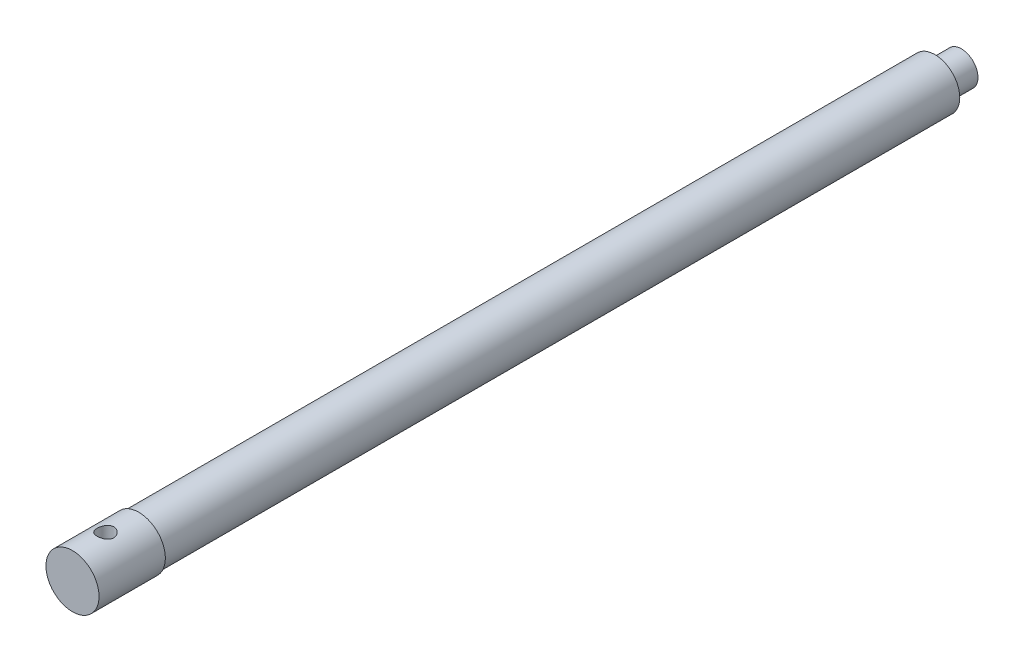
ISO-10303-21;
HEADER;
FILE_DESCRIPTION(('STEP AP214'),'2;1');
FILE_NAME('part.step','',(''),(''),'','','');
FILE_SCHEMA(('AUTOMOTIVE_DESIGN { 1 0 10303 214 1 1 1 1 }'));
ENDSEC;
DATA;
#1=APPLICATION_CONTEXT('core data for automotive mechanical design processes');
#2=APPLICATION_PROTOCOL_DEFINITION('international standard','automotive_design',2000,#1);
#3=PRODUCT_CONTEXT('',#1,'mechanical');
#4=PRODUCT('Part','Part','',(#3));
#5=PRODUCT_RELATED_PRODUCT_CATEGORY('part','',(#4));
#6=PRODUCT_DEFINITION_FORMATION('','',#4);
#7=PRODUCT_DEFINITION_CONTEXT('part definition',#1,'design');
#8=PRODUCT_DEFINITION('design','',#6,#7);
#9=PRODUCT_DEFINITION_SHAPE('','',#8);
#10=(LENGTH_UNIT() NAMED_UNIT(*) SI_UNIT(.MILLI.,.METRE.));
#11=(NAMED_UNIT(*) PLANE_ANGLE_UNIT() SI_UNIT($,.RADIAN.));
#12=(NAMED_UNIT(*) SI_UNIT($,.STERADIAN.) SOLID_ANGLE_UNIT());
#13=UNCERTAINTY_MEASURE_WITH_UNIT(LENGTH_MEASURE(1.E-05),#10,'distance_accuracy_value','');
#14=(GEOMETRIC_REPRESENTATION_CONTEXT(3) GLOBAL_UNCERTAINTY_ASSIGNED_CONTEXT((#13)) GLOBAL_UNIT_ASSIGNED_CONTEXT((#10,
#11,#12)) REPRESENTATION_CONTEXT('',''));
#15=CARTESIAN_POINT('',(0.,0.,0.));
#16=DIRECTION('',(0.,0.,1.));
#17=DIRECTION('',(1.,0.,0.));
#18=AXIS2_PLACEMENT_3D('',#15,#16,#17);
#19=CARTESIAN_POINT('',(0.,0.,260.));
#20=DIRECTION('',(0.,0.,-1.));
#21=DIRECTION('',(-1.,0.,0.));
#22=AXIS2_PLACEMENT_3D('',#19,#20,#21);
#23=CYLINDRICAL_SURFACE('',#22,8.);
#24=CARTESIAN_POINT('',(0.,0.,260.));
#25=DIRECTION('',(0.,0.,1.));
#26=DIRECTION('',(1.,0.,0.));
#27=AXIS2_PLACEMENT_3D('',#24,#25,#26);
#28=CIRCLE('',#27,8.);
#29=CARTESIAN_POINT('',(8.,0.,260.));
#30=VERTEX_POINT('',#29);
#31=EDGE_CURVE('E89',#30,#30,#28,.T.);
#32=ORIENTED_EDGE('',*,*,#31,.F.);
#33=EDGE_LOOP('',(#32));
#34=FACE_BOUND('',#33,.T.);
#35=CARTESIAN_POINT('',(0.,0.,240.));
#36=DIRECTION('',(0.,0.,1.));
#37=DIRECTION('',(1.,0.,0.));
#38=AXIS2_PLACEMENT_3D('',#35,#36,#37);
#39=CIRCLE('',#38,8.);
#40=CARTESIAN_POINT('',(8.,0.,240.));
#41=VERTEX_POINT('',#40);
#42=EDGE_CURVE('E92',#41,#41,#39,.T.);
#43=ORIENTED_EDGE('',*,*,#42,.T.);
#44=EDGE_LOOP('',(#43));
#45=FACE_BOUND('',#44,.T.);
#46=CARTESIAN_POINT('',(0.,-8.,247.564612311342));
#47=CARTESIAN_POINT('',(0.136878370349093,-7.9999993175598,247.564613204517));
#48=CARTESIAN_POINT('',(0.273766105005719,-7.99645389969682,247.57589076523));
#49=CARTESIAN_POINT('',(0.543538419176897,-7.98265788177613,247.62058479442));
#50=CARTESIAN_POINT('',(0.676422085451815,-7.97240576399719,247.65400627407));
#51=CARTESIAN_POINT('',(0.934257087301605,-7.94631631395819,247.741751053733));
#52=CARTESIAN_POINT('',(1.05922035397159,-7.9304876299805,247.796042000648));
#53=CARTESIAN_POINT('',(1.29826960469291,-7.89487938322185,247.923846946698));
#54=CARTESIAN_POINT('',(1.41235387088977,-7.8750991979981,247.997363974903));
#55=CARTESIAN_POINT('',(1.62993066990456,-7.83300427480565,248.163924295376));
#56=CARTESIAN_POINT('',(1.73304005631331,-7.81063431853978,248.257454081464));
#57=CARTESIAN_POINT('',(1.92239476407398,-7.76620092748417,248.460349096169));
#58=CARTESIAN_POINT('',(2.00863694579739,-7.74413755046915,248.569717266331));
#59=CARTESIAN_POINT('',(2.16388672966227,-7.70222289396344,248.804501438958));
#60=CARTESIAN_POINT('',(2.23241568300258,-7.68243976603591,248.930247266396));
#61=CARTESIAN_POINT('',(2.34719482153343,-7.64815603598468,249.192196941305));
#62=CARTESIAN_POINT('',(2.39345087543889,-7.63365404257377,249.328398022929));
#63=CARTESIAN_POINT('',(2.46096919860067,-7.61215213969001,249.603068466246));
#64=CARTESIAN_POINT('',(2.48294220015729,-7.60493945859017,249.741345998619));
#65=CARTESIAN_POINT('',(2.50349110073976,-7.59820110281901,250.019798549165));
#66=CARTESIAN_POINT('',(2.50207321991544,-7.59867338454668,250.159973052985));
#67=CARTESIAN_POINT('',(2.47643649465479,-7.60706378150876,250.43236123188));
#68=CARTESIAN_POINT('',(2.45312115738766,-7.61468683491897,250.564670563065));
#69=CARTESIAN_POINT('',(2.38581626711253,-7.63604051304978,250.823396624416));
#70=CARTESIAN_POINT('',(2.34182451689103,-7.64977178686229,250.949812726759));
#71=CARTESIAN_POINT('',(2.23377749362558,-7.68202088028592,251.195316200207));
#72=CARTESIAN_POINT('',(2.16943851324168,-7.70060569321648,251.314269532726));
#73=CARTESIAN_POINT('',(2.02272041475699,-7.74043713160139,251.5399878471));
#74=CARTESIAN_POINT('',(1.94033661043156,-7.76168444789101,251.646749651849));
#75=CARTESIAN_POINT('',(1.75543390836425,-7.80563055600986,251.850162198176));
#76=CARTESIAN_POINT('',(1.65216914118564,-7.82835139211391,251.946131426901));
#77=CARTESIAN_POINT('',(1.43072881619106,-7.87183141519161,252.119556098501));
#78=CARTESIAN_POINT('',(1.31255215469802,-7.89259045676745,252.19701016978));
#79=CARTESIAN_POINT('',(1.06332922093089,-7.93002589780383,252.331667688544));
#80=CARTESIAN_POINT('',(0.93218981383855,-7.94666921296416,252.38870858227));
#81=CARTESIAN_POINT('',(0.661535955565294,-7.97375911657108,252.479718313045));
#82=CARTESIAN_POINT('',(0.522024061449225,-7.98420758650304,252.513694155818));
#83=CARTESIAN_POINT('',(0.244370314580702,-7.99742778790027,252.5564483965));
#84=CARTESIAN_POINT('',(0.106383697577698,-8.00048045790873,252.566149398529));
#85=CARTESIAN_POINT('',(-0.169260611465159,-7.99939599461967,252.562679858067));
#86=CARTESIAN_POINT('',(-0.306918348613005,-7.9952599116227,252.549512656696));
#87=CARTESIAN_POINT('',(-0.574438665951691,-7.98044727539523,252.501421126129));
#88=CARTESIAN_POINT('',(-0.704409956841874,-7.96993586221374,252.467045776117));
#89=CARTESIAN_POINT('',(-0.956703857722755,-7.94360242758579,252.378183606608));
#90=CARTESIAN_POINT('',(-1.07902552089811,-7.92777975028688,252.323694303292));
#91=CARTESIAN_POINT('',(-1.31586481334438,-7.89197085518848,252.194665878244));
#92=CARTESIAN_POINT('',(-1.4301194795756,-7.87189253635335,252.119670336348));
#93=CARTESIAN_POINT('',(-1.64473170192053,-7.82986820006859,251.952305891107));
#94=CARTESIAN_POINT('',(-1.7450854760879,-7.80792167695774,251.859932275852));
#95=CARTESIAN_POINT('',(-1.93317492583804,-7.76353989766283,251.656094531237));
#96=CARTESIAN_POINT('',(-2.02025304679064,-7.74111973412882,251.544018983863));
#97=CARTESIAN_POINT('',(-2.17442500490304,-7.69923894191211,251.306359078588));
#98=CARTESIAN_POINT('',(-2.24151915946859,-7.67977826622621,251.180774935288));
#99=CARTESIAN_POINT('',(-2.35340166961084,-7.64623564661738,250.919921965601));
#100=CARTESIAN_POINT('',(-2.39827639112025,-7.63213292713749,250.78469301247));
#101=CARTESIAN_POINT('',(-2.46445788636181,-7.6110234168862,250.508067324844));
#102=CARTESIAN_POINT('',(-2.48577362827989,-7.60401392602456,250.366672958655));
#103=CARTESIAN_POINT('',(-2.50358812316252,-7.59816585427753,250.088604136181));
#104=CARTESIAN_POINT('',(-2.50116559243272,-7.59897209200283,249.952005403647));
#105=CARTESIAN_POINT('',(-2.47417636257668,-7.60780180751807,249.681263141458));
#106=CARTESIAN_POINT('',(-2.44961069645025,-7.61582494863208,249.547119497568));
#107=CARTESIAN_POINT('',(-2.37975459827236,-7.63793628366779,249.287024232158));
#108=CARTESIAN_POINT('',(-2.33477284812018,-7.65193396380513,249.160981429155));
#109=CARTESIAN_POINT('',(-2.22560454670001,-7.68439408509127,248.918131484274));
#110=CARTESIAN_POINT('',(-2.16141408888475,-7.70285743429343,248.801326227185));
#111=CARTESIAN_POINT('',(-2.01271350026987,-7.74306974067005,248.575320370462));
#112=CARTESIAN_POINT('',(-1.92750667048265,-7.76491897845913,248.466596052341));
#113=CARTESIAN_POINT('',(-1.7404179928096,-7.8089799764242,248.264639655118));
#114=CARTESIAN_POINT('',(-1.63853168468878,-7.83119183213309,248.171411733359));
#115=CARTESIAN_POINT('',(-1.41697332564669,-7.87434543904947,248.000047234616));
#116=CARTESIAN_POINT('',(-1.29682914897476,-7.89522203461346,247.922502838442));
#117=CARTESIAN_POINT('',(-1.0445582760273,-7.93253538593756,247.788814481063));
#118=CARTESIAN_POINT('',(-0.912436315590902,-7.94897388631644,247.732662107058));
#119=CARTESIAN_POINT('',(-0.651495270747964,-7.97441301466941,247.647429576125));
#120=CARTESIAN_POINT('',(-0.523340674225096,-7.98392481612283,247.616462576731));
#121=CARTESIAN_POINT('',(-0.263459790880496,-7.99671800680967,247.575055591406));
#122=CARTESIAN_POINT('',(-0.13173423227935,-8.00000065679286,247.564611451734));
#123=CARTESIAN_POINT('',(0.,-8.,247.564612311342));
#124=B_SPLINE_CURVE_WITH_KNOTS('',3,(#46,#47,#48,#49,#50,#51,#52,#53,#54,#55,#56,#57,#58,#59,
#60,#61,#62,#63,#64,#65,#66,#67,#68,#69,#70,#71,#72,#73,#74,#75,#76,#77,#78,#79,#80,#81,#82,#83,
#84,#85,#86,#87,#88,#89,#90,#91,#92,#93,#94,#95,#96,#97,#98,#99,#100,#101,#102,#103,#104,#105,
#106,#107,#108,#109,#110,#111,#112,#113,#114,#115,#116,#117,#118,#119,#120,#121,#122,#123),
.UNSPECIFIED.,.T.,.F.,(4,2,2,2,2,2,2,2,2,2,2,2,2,2,2,2,2,2,2,2,2,2,2,2,2,2,2,2,2,2,2,2,2,2,2,2,
2,2,4),(0.,0.410150898865022,0.820394646698132,1.23000495840485,1.63967984311678,
2.06075644390315,2.48191134862553,2.91347542494989,3.34492572559053,3.76338300334415,
4.18172900590277,4.58353834844333,4.98539039958116,5.39311285441084,5.80094132020714,
6.22733494559199,6.65376014826608,7.0835092137954,7.51312768989105,7.92615137096473,
8.33911471298724,8.74181253445743,9.14456010068997,9.55712649476689,9.9698049141852,
10.3988355742628,10.8278594196742,11.2552023150671,11.6823824779468,12.0902440696666,
12.4980866352126,12.8999582681243,13.3019116867944,13.7195902803182,14.1373807476578,
14.5688133627192,15.0000761335177,15.3948927332218,15.7896294154519),.UNSPECIFIED.);
#125=CARTESIAN_POINT('',(0.,-8.,247.564612311342));
#126=VERTEX_POINT('',#125);
#127=EDGE_CURVE('E39',#126,#126,#124,.T.);
#128=ORIENTED_EDGE('',*,*,#127,.F.);
#129=EDGE_LOOP('',(#128));
#130=FACE_BOUND('',#129,.T.);
#131=CARTESIAN_POINT('',(0.,8.,247.564612311342));
#132=CARTESIAN_POINT('',(-0.136878370349093,7.9999993175598,247.564613204517));
#133=CARTESIAN_POINT('',(-0.273766105005719,7.99645389969682,247.57589076523));
#134=CARTESIAN_POINT('',(-0.543538419176897,7.98265788177613,247.62058479442));
#135=CARTESIAN_POINT('',(-0.676422085451815,7.97240576399719,247.65400627407));
#136=CARTESIAN_POINT('',(-0.934257087301605,7.94631631395819,247.741751053733));
#137=CARTESIAN_POINT('',(-1.05922035397159,7.9304876299805,247.796042000648));
#138=CARTESIAN_POINT('',(-1.29826960469291,7.89487938322185,247.923846946698));
#139=CARTESIAN_POINT('',(-1.41235387088977,7.8750991979981,247.997363974903));
#140=CARTESIAN_POINT('',(-1.62993066990456,7.83300427480565,248.163924295376));
#141=CARTESIAN_POINT('',(-1.73304005631331,7.81063431853978,248.257454081464));
#142=CARTESIAN_POINT('',(-1.92239476407398,7.76620092748417,248.460349096169));
#143=CARTESIAN_POINT('',(-2.00863694579739,7.74413755046915,248.569717266331));
#144=CARTESIAN_POINT('',(-2.16388672966227,7.70222289396344,248.804501438958));
#145=CARTESIAN_POINT('',(-2.23241568300258,7.68243976603591,248.930247266396));
#146=CARTESIAN_POINT('',(-2.34719482153343,7.64815603598468,249.192196941305));
#147=CARTESIAN_POINT('',(-2.39345087543889,7.63365404257377,249.328398022929));
#148=CARTESIAN_POINT('',(-2.46096919860067,7.61215213969001,249.603068466246));
#149=CARTESIAN_POINT('',(-2.48294220015729,7.60493945859017,249.741345998619));
#150=CARTESIAN_POINT('',(-2.50349110073976,7.59820110281901,250.019798549165));
#151=CARTESIAN_POINT('',(-2.50207321991544,7.59867338454668,250.159973052985));
#152=CARTESIAN_POINT('',(-2.47643649465479,7.60706378150876,250.43236123188));
#153=CARTESIAN_POINT('',(-2.45312115738766,7.61468683491897,250.564670563065));
#154=CARTESIAN_POINT('',(-2.38581626711253,7.63604051304978,250.823396624416));
#155=CARTESIAN_POINT('',(-2.34182451689103,7.64977178686229,250.949812726759));
#156=CARTESIAN_POINT('',(-2.23377749362558,7.68202088028592,251.195316200207));
#157=CARTESIAN_POINT('',(-2.16943851324168,7.70060569321648,251.314269532726));
#158=CARTESIAN_POINT('',(-2.02272041475699,7.74043713160139,251.5399878471));
#159=CARTESIAN_POINT('',(-1.94033661043156,7.76168444789101,251.646749651849));
#160=CARTESIAN_POINT('',(-1.75543390836425,7.80563055600986,251.850162198176));
#161=CARTESIAN_POINT('',(-1.65216914118564,7.82835139211391,251.946131426901));
#162=CARTESIAN_POINT('',(-1.43072881619106,7.87183141519161,252.119556098501));
#163=CARTESIAN_POINT('',(-1.31255215469802,7.89259045676745,252.19701016978));
#164=CARTESIAN_POINT('',(-1.06332922093089,7.93002589780383,252.331667688544));
#165=CARTESIAN_POINT('',(-0.93218981383855,7.94666921296416,252.38870858227));
#166=CARTESIAN_POINT('',(-0.661535955565294,7.97375911657108,252.479718313045));
#167=CARTESIAN_POINT('',(-0.522024061449225,7.98420758650304,252.513694155818));
#168=CARTESIAN_POINT('',(-0.244370314580702,7.99742778790027,252.5564483965));
#169=CARTESIAN_POINT('',(-0.106383697577698,8.00048045790873,252.566149398529));
#170=CARTESIAN_POINT('',(0.169260611465159,7.99939599461967,252.562679858067));
#171=CARTESIAN_POINT('',(0.306918348613005,7.9952599116227,252.549512656696));
#172=CARTESIAN_POINT('',(0.574438665951691,7.98044727539523,252.501421126129));
#173=CARTESIAN_POINT('',(0.704409956841874,7.96993586221374,252.467045776117));
#174=CARTESIAN_POINT('',(0.956703857722755,7.94360242758579,252.378183606608));
#175=CARTESIAN_POINT('',(1.07902552089811,7.92777975028688,252.323694303292));
#176=CARTESIAN_POINT('',(1.31586481334438,7.89197085518848,252.194665878244));
#177=CARTESIAN_POINT('',(1.4301194795756,7.87189253635335,252.119670336348));
#178=CARTESIAN_POINT('',(1.64473170192053,7.82986820006859,251.952305891107));
#179=CARTESIAN_POINT('',(1.7450854760879,7.80792167695774,251.859932275852));
#180=CARTESIAN_POINT('',(1.93317492583804,7.76353989766283,251.656094531237));
#181=CARTESIAN_POINT('',(2.02025304679064,7.74111973412882,251.544018983863));
#182=CARTESIAN_POINT('',(2.17442500490304,7.69923894191211,251.306359078588));
#183=CARTESIAN_POINT('',(2.24151915946859,7.67977826622621,251.180774935288));
#184=CARTESIAN_POINT('',(2.35340166961084,7.64623564661738,250.919921965601));
#185=CARTESIAN_POINT('',(2.39827639112025,7.63213292713749,250.78469301247));
#186=CARTESIAN_POINT('',(2.46445788636181,7.6110234168862,250.508067324844));
#187=CARTESIAN_POINT('',(2.48577362827989,7.60401392602456,250.366672958655));
#188=CARTESIAN_POINT('',(2.50358812316252,7.59816585427753,250.088604136181));
#189=CARTESIAN_POINT('',(2.50116559243272,7.59897209200283,249.952005403647));
#190=CARTESIAN_POINT('',(2.47417636257668,7.60780180751807,249.681263141458));
#191=CARTESIAN_POINT('',(2.44961069645025,7.61582494863208,249.547119497568));
#192=CARTESIAN_POINT('',(2.37975459827236,7.63793628366779,249.287024232158));
#193=CARTESIAN_POINT('',(2.33477284812018,7.65193396380513,249.160981429155));
#194=CARTESIAN_POINT('',(2.22560454670001,7.68439408509127,248.918131484274));
#195=CARTESIAN_POINT('',(2.16141408888475,7.70285743429343,248.801326227185));
#196=CARTESIAN_POINT('',(2.01271350026987,7.74306974067005,248.575320370462));
#197=CARTESIAN_POINT('',(1.92750667048265,7.76491897845913,248.466596052341));
#198=CARTESIAN_POINT('',(1.7404179928096,7.8089799764242,248.264639655118));
#199=CARTESIAN_POINT('',(1.63853168468878,7.83119183213309,248.171411733359));
#200=CARTESIAN_POINT('',(1.41697332564669,7.87434543904947,248.000047234616));
#201=CARTESIAN_POINT('',(1.29682914897476,7.89522203461346,247.922502838442));
#202=CARTESIAN_POINT('',(1.0445582760273,7.93253538593756,247.788814481063));
#203=CARTESIAN_POINT('',(0.912436315590902,7.94897388631644,247.732662107058));
#204=CARTESIAN_POINT('',(0.651495270747964,7.97441301466941,247.647429576125));
#205=CARTESIAN_POINT('',(0.523340674225096,7.98392481612283,247.616462576731));
#206=CARTESIAN_POINT('',(0.263459790880496,7.99671800680967,247.575055591406));
#207=CARTESIAN_POINT('',(0.13173423227935,8.00000065679286,247.564611451734));
#208=CARTESIAN_POINT('',(0.,8.,247.564612311342));
#209=B_SPLINE_CURVE_WITH_KNOTS('',3,(#131,#132,#133,#134,#135,#136,#137,#138,#139,#140,#141,
#142,#143,#144,#145,#146,#147,#148,#149,#150,#151,#152,#153,#154,#155,#156,#157,#158,#159,#160,
#161,#162,#163,#164,#165,#166,#167,#168,#169,#170,#171,#172,#173,#174,#175,#176,#177,#178,#179,
#180,#181,#182,#183,#184,#185,#186,#187,#188,#189,#190,#191,#192,#193,#194,#195,#196,#197,#198,
#199,#200,#201,#202,#203,#204,#205,#206,#207,#208),.UNSPECIFIED.,.T.,.F.,(4,2,2,2,2,2,2,2,2,2,2,
2,2,2,2,2,2,2,2,2,2,2,2,2,2,2,2,2,2,2,2,2,2,2,2,2,2,2,4),(0.,0.410150898865022,
0.820394646698132,1.23000495840485,1.63967984311678,2.06075644390315,2.48191134862553,
2.91347542494989,3.34492572559053,3.76338300334415,4.18172900590277,4.58353834844333,
4.98539039958116,5.39311285441084,5.80094132020714,6.22733494559199,6.65376014826608,
7.0835092137954,7.51312768989105,7.92615137096473,8.33911471298724,8.74181253445743,
9.14456010068997,9.55712649476689,9.9698049141852,10.3988355742628,10.8278594196742,
11.2552023150671,11.6823824779468,12.0902440696666,12.4980866352126,12.8999582681243,
13.3019116867944,13.7195902803182,14.1373807476578,14.5688133627192,15.0000761335177,
15.3948927332218,15.7896294154519),.UNSPECIFIED.);
#210=CARTESIAN_POINT('',(0.,8.,247.564612311342));
#211=VERTEX_POINT('',#210);
#212=EDGE_CURVE('E10',#211,#211,#209,.T.);
#213=ORIENTED_EDGE('',*,*,#212,.F.);
#214=EDGE_LOOP('',(#213));
#215=FACE_BOUND('',#214,.T.);
#216=ADVANCED_FACE('F28',(#34,#45,#130,#215),#23,.T.);
#217=CARTESIAN_POINT('',(0.,0.,0.));
#218=DIRECTION('',(0.,0.,1.));
#219=DIRECTION('',(1.,0.,0.));
#220=AXIS2_PLACEMENT_3D('',#217,#218,#219);
#221=PLANE('',#220);
#222=CARTESIAN_POINT('',(0.,0.,0.));
#223=DIRECTION('',(0.,0.,1.));
#224=DIRECTION('',(1.,0.,0.));
#225=AXIS2_PLACEMENT_3D('',#222,#223,#224);
#226=CIRCLE('',#225,7.5);
#227=CARTESIAN_POINT('',(7.5,0.,0.));
#228=VERTEX_POINT('',#227);
#229=EDGE_CURVE('E96',#228,#228,#226,.T.);
#230=ORIENTED_EDGE('',*,*,#229,.F.);
#231=EDGE_LOOP('',(#230));
#232=FACE_BOUND('',#231,.T.);
#233=CARTESIAN_POINT('',(0.,0.,0.));
#234=DIRECTION('',(0.,0.,1.));
#235=DIRECTION('',(1.,0.,0.));
#236=AXIS2_PLACEMENT_3D('',#233,#234,#235);
#237=CIRCLE('',#236,5.);
#238=CARTESIAN_POINT('',(5.,0.,0.));
#239=VERTEX_POINT('',#238);
#240=EDGE_CURVE('E43',#239,#239,#237,.F.);
#241=ORIENTED_EDGE('',*,*,#240,.F.);
#242=EDGE_LOOP('',(#241));
#243=FACE_BOUND('',#242,.T.);
#244=ADVANCED_FACE('F76',(#232,#243),#221,.F.);
#245=CARTESIAN_POINT('',(0.,0.,240.));
#246=DIRECTION('',(0.,0.,-1.));
#247=DIRECTION('',(-1.,0.,0.));
#248=AXIS2_PLACEMENT_3D('',#245,#246,#247);
#249=CYLINDRICAL_SURFACE('',#248,7.5);
#250=CARTESIAN_POINT('',(0.,0.,240.));
#251=DIRECTION('',(0.,0.,1.));
#252=DIRECTION('',(1.,0.,0.));
#253=AXIS2_PLACEMENT_3D('',#250,#251,#252);
#254=CIRCLE('',#253,7.5);
#255=CARTESIAN_POINT('',(7.5,0.,240.));
#256=VERTEX_POINT('',#255);
#257=EDGE_CURVE('E47',#256,#256,#254,.T.);
#258=ORIENTED_EDGE('',*,*,#257,.F.);
#259=EDGE_LOOP('',(#258));
#260=FACE_BOUND('',#259,.T.);
#261=ORIENTED_EDGE('',*,*,#229,.T.);
#262=EDGE_LOOP('',(#261));
#263=FACE_BOUND('',#262,.T.);
#264=ADVANCED_FACE('F30',(#260,#263),#249,.T.);
#265=CARTESIAN_POINT('',(0.,0.,240.));
#266=DIRECTION('',(0.,0.,1.));
#267=DIRECTION('',(1.,0.,0.));
#268=AXIS2_PLACEMENT_3D('',#265,#266,#267);
#269=PLANE('',#268);
#270=ORIENTED_EDGE('',*,*,#42,.F.);
#271=EDGE_LOOP('',(#270));
#272=FACE_BOUND('',#271,.T.);
#273=ORIENTED_EDGE('',*,*,#257,.T.);
#274=EDGE_LOOP('',(#273));
#275=FACE_BOUND('',#274,.T.);
#276=ADVANCED_FACE('F69',(#272,#275),#269,.F.);
#277=CARTESIAN_POINT('',(0.,0.,260.));
#278=DIRECTION('',(0.,0.,1.));
#279=DIRECTION('',(1.,0.,0.));
#280=AXIS2_PLACEMENT_3D('',#277,#278,#279);
#281=PLANE('',#280);
#282=ORIENTED_EDGE('',*,*,#31,.T.);
#283=EDGE_LOOP('',(#282));
#284=FACE_BOUND('',#283,.T.);
#285=ADVANCED_FACE('F66',(#284),#281,.T.);
#286=CARTESIAN_POINT('',(0.,0.,-8.));
#287=DIRECTION('',(0.,0.,1.));
#288=DIRECTION('',(1.,0.,0.));
#289=AXIS2_PLACEMENT_3D('',#286,#287,#288);
#290=CYLINDRICAL_SURFACE('',#289,5.);
#291=CARTESIAN_POINT('',(0.,0.,-8.));
#292=DIRECTION('',(0.,0.,-1.));
#293=DIRECTION('',(-1.,0.,0.));
#294=AXIS2_PLACEMENT_3D('',#291,#292,#293);
#295=CIRCLE('',#294,5.);
#296=CARTESIAN_POINT('',(-5.,0.,-8.));
#297=VERTEX_POINT('',#296);
#298=EDGE_CURVE('E94',#297,#297,#295,.T.);
#299=ORIENTED_EDGE('',*,*,#298,.F.);
#300=EDGE_LOOP('',(#299));
#301=FACE_BOUND('',#300,.T.);
#302=ORIENTED_EDGE('',*,*,#240,.T.);
#303=EDGE_LOOP('',(#302));
#304=FACE_BOUND('',#303,.T.);
#305=ADVANCED_FACE('F62',(#301,#304),#290,.T.);
#306=CARTESIAN_POINT('',(0.,0.,-8.));
#307=DIRECTION('',(0.,0.,-1.));
#308=DIRECTION('',(-1.,0.,0.));
#309=AXIS2_PLACEMENT_3D('',#306,#307,#308);
#310=PLANE('',#309);
#311=ORIENTED_EDGE('',*,*,#298,.T.);
#312=EDGE_LOOP('',(#311));
#313=FACE_BOUND('',#312,.T.);
#314=ADVANCED_FACE('F58',(#313),#310,.T.);
#315=CARTESIAN_POINT('',(0.,8.,250.064612311342));
#316=DIRECTION('',(0.,-1.,0.));
#317=DIRECTION('',(0.,0.,-1.));
#318=AXIS2_PLACEMENT_3D('',#315,#316,#317);
#319=CYLINDRICAL_SURFACE('',#318,2.5);
#320=ORIENTED_EDGE('',*,*,#127,.T.);
#321=EDGE_LOOP('',(#320));
#322=FACE_BOUND('',#321,.T.);
#323=ORIENTED_EDGE('',*,*,#212,.T.);
#324=EDGE_LOOP('',(#323));
#325=FACE_BOUND('',#324,.T.);
#326=ADVANCED_FACE('F54',(#322,#325),#319,.F.);
#327=CLOSED_SHELL('',(#216,#244,#264,#276,#285,#305,#314,#326));
#328=MANIFOLD_SOLID_BREP('B2',#327);
#329=ADVANCED_BREP_SHAPE_REPRESENTATION('',(#18,#328),#14);
#330=SHAPE_DEFINITION_REPRESENTATION(#9,#329);
ENDSEC;
END-ISO-10303-21;
